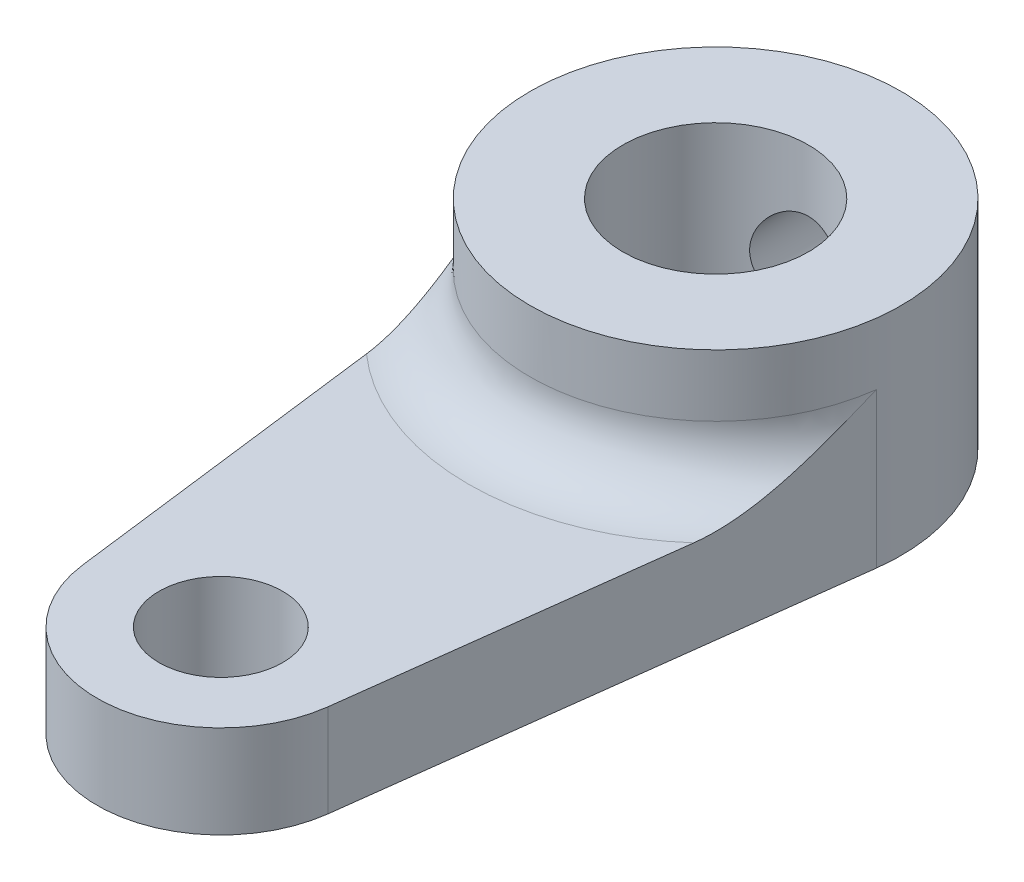
ISO-10303-21;
HEADER;
FILE_DESCRIPTION(('STEP AP214'),'2;1');
FILE_NAME('part.step','',(''),(''),'','','');
FILE_SCHEMA(('AUTOMOTIVE_DESIGN { 1 0 10303 214 1 1 1 1 }'));
ENDSEC;
DATA;
#1=APPLICATION_CONTEXT('core data for automotive mechanical design processes');
#2=APPLICATION_PROTOCOL_DEFINITION('international standard','automotive_design',2000,#1);
#3=PRODUCT_CONTEXT('',#1,'mechanical');
#4=PRODUCT('Part','Part','',(#3));
#5=PRODUCT_RELATED_PRODUCT_CATEGORY('part','',(#4));
#6=PRODUCT_DEFINITION_FORMATION('','',#4);
#7=PRODUCT_DEFINITION_CONTEXT('part definition',#1,'design');
#8=PRODUCT_DEFINITION('design','',#6,#7);
#9=PRODUCT_DEFINITION_SHAPE('','',#8);
#10=(LENGTH_UNIT() NAMED_UNIT(*) SI_UNIT(.MILLI.,.METRE.));
#11=(NAMED_UNIT(*) PLANE_ANGLE_UNIT() SI_UNIT($,.RADIAN.));
#12=(NAMED_UNIT(*) SI_UNIT($,.STERADIAN.) SOLID_ANGLE_UNIT());
#13=UNCERTAINTY_MEASURE_WITH_UNIT(LENGTH_MEASURE(1.E-05),#10,'distance_accuracy_value','');
#14=(GEOMETRIC_REPRESENTATION_CONTEXT(3) GLOBAL_UNCERTAINTY_ASSIGNED_CONTEXT((#13)) GLOBAL_UNIT_ASSIGNED_CONTEXT((#10,
#11,#12)) REPRESENTATION_CONTEXT('',''));
#15=CARTESIAN_POINT('',(0.,0.,0.));
#16=DIRECTION('',(0.,0.,1.));
#17=DIRECTION('',(1.,0.,0.));
#18=AXIS2_PLACEMENT_3D('',#15,#16,#17);
#19=CARTESIAN_POINT('',(0.,3.,-16.));
#20=DIRECTION('',(0.,1.,0.));
#21=DIRECTION('',(0.,0.,1.));
#22=AXIS2_PLACEMENT_3D('',#19,#20,#21);
#23=PLANE('',#22);
#24=DIRECTION('',(0.125,0.,-0.992156741649221));
#25=VECTOR('',#24,1.);
#26=CARTESIAN_POINT('',(5.95294044989533,3.,-15.25));
#27=LINE('',#26,#25);
#28=CARTESIAN_POINT('',(3.96862696659688,3.,0.5));
#29=VERTEX_POINT('',#28);
#30=CARTESIAN_POINT('',(5.29150262212918,3.,-10.));
#31=VERTEX_POINT('',#30);
#32=EDGE_CURVE('E105',#29,#31,#27,.T.);
#33=ORIENTED_EDGE('',*,*,#32,.T.);
#34=CARTESIAN_POINT('',(0.,3.,-16.));
#35=DIRECTION('',(0.,1.,0.));
#36=DIRECTION('',(0.,0.,1.));
#37=AXIS2_PLACEMENT_3D('',#34,#35,#36);
#38=CIRCLE('',#37,8.);
#39=CARTESIAN_POINT('',(-5.29150262212918,3.,-10.));
#40=VERTEX_POINT('',#39);
#41=EDGE_CURVE('E60',#31,#40,#38,.F.);
#42=ORIENTED_EDGE('',*,*,#41,.T.);
#43=DIRECTION('',(0.125,0.,0.992156741649221));
#44=VECTOR('',#43,1.);
#45=CARTESIAN_POINT('',(-5.95294044989533,3.,-15.25));
#46=LINE('',#45,#44);
#47=CARTESIAN_POINT('',(-3.96862696659688,3.,0.499999999999999));
#48=VERTEX_POINT('',#47);
#49=EDGE_CURVE('E83',#40,#48,#46,.T.);
#50=ORIENTED_EDGE('',*,*,#49,.T.);
#51=CARTESIAN_POINT('',(0.,3.,0.));
#52=DIRECTION('',(0.,1.,0.));
#53=DIRECTION('',(0.,0.,1.));
#54=AXIS2_PLACEMENT_3D('',#51,#52,#53);
#55=CIRCLE('',#54,4.);
#56=EDGE_CURVE('E87',#48,#29,#55,.T.);
#57=ORIENTED_EDGE('',*,*,#56,.T.);
#58=EDGE_LOOP('',(#33,#42,#50,#57));
#59=FACE_BOUND('',#58,.T.);
#60=CARTESIAN_POINT('',(0.,3.,0.));
#61=DIRECTION('',(0.,1.,0.));
#62=DIRECTION('',(0.,0.,1.));
#63=AXIS2_PLACEMENT_3D('',#60,#61,#62);
#64=CIRCLE('',#63,2.);
#65=CARTESIAN_POINT('',(0.,3.,2.));
#66=VERTEX_POINT('',#65);
#67=EDGE_CURVE('E114',#66,#66,#64,.T.);
#68=ORIENTED_EDGE('',*,*,#67,.F.);
#69=EDGE_LOOP('',(#68));
#70=FACE_BOUND('',#69,.T.);
#71=ADVANCED_FACE('F33',(#59,#70),#23,.T.);
#72=CARTESIAN_POINT('',(0.,0.,-16.));
#73=DIRECTION('',(0.,1.,0.));
#74=DIRECTION('',(0.,0.,1.));
#75=AXIS2_PLACEMENT_3D('',#72,#73,#74);
#76=PLANE('',#75);
#77=CARTESIAN_POINT('',(0.,0.,-16.));
#78=DIRECTION('',(0.,1.,0.));
#79=DIRECTION('',(0.,0.,1.));
#80=AXIS2_PLACEMENT_3D('',#77,#78,#79);
#81=CIRCLE('',#80,3.);
#82=CARTESIAN_POINT('',(0.,0.,-13.));
#83=VERTEX_POINT('',#82);
#84=EDGE_CURVE('E124',#83,#83,#81,.T.);
#85=ORIENTED_EDGE('',*,*,#84,.T.);
#86=EDGE_LOOP('',(#85));
#87=FACE_BOUND('',#86,.T.);
#88=CARTESIAN_POINT('',(0.,0.,-16.));
#89=DIRECTION('',(0.,1.,0.));
#90=DIRECTION('',(0.,0.,1.));
#91=AXIS2_PLACEMENT_3D('',#88,#89,#90);
#92=CIRCLE('',#91,6.);
#93=CARTESIAN_POINT('',(5.95294044989533,0.,-15.25));
#94=VERTEX_POINT('',#93);
#95=CARTESIAN_POINT('',(-5.95294044989533,0.,-15.25));
#96=VERTEX_POINT('',#95);
#97=EDGE_CURVE('E111',#94,#96,#92,.T.);
#98=ORIENTED_EDGE('',*,*,#97,.F.);
#99=DIRECTION('',(0.125,0.,-0.992156741649221));
#100=VECTOR('',#99,1.);
#101=CARTESIAN_POINT('',(5.95294044989533,0.,-15.25));
#102=LINE('',#101,#100);
#103=CARTESIAN_POINT('',(3.96862696659688,0.,0.5));
#104=VERTEX_POINT('',#103);
#105=EDGE_CURVE('E91',#104,#94,#102,.T.);
#106=ORIENTED_EDGE('',*,*,#105,.F.);
#107=CARTESIAN_POINT('',(0.,0.,0.));
#108=DIRECTION('',(0.,1.,0.));
#109=DIRECTION('',(0.,0.,1.));
#110=AXIS2_PLACEMENT_3D('',#107,#108,#109);
#111=CIRCLE('',#110,4.);
#112=CARTESIAN_POINT('',(-3.96862696659688,0.,0.499999999999999));
#113=VERTEX_POINT('',#112);
#114=EDGE_CURVE('E116',#113,#104,#111,.T.);
#115=ORIENTED_EDGE('',*,*,#114,.F.);
#116=DIRECTION('',(0.125,0.,0.992156741649221));
#117=VECTOR('',#116,1.);
#118=CARTESIAN_POINT('',(-5.95294044989533,0.,-15.25));
#119=LINE('',#118,#117);
#120=EDGE_CURVE('E97',#96,#113,#119,.T.);
#121=ORIENTED_EDGE('',*,*,#120,.F.);
#122=EDGE_LOOP('',(#98,#106,#115,#121));
#123=FACE_BOUND('',#122,.T.);
#124=CARTESIAN_POINT('',(0.,0.,0.));
#125=DIRECTION('',(0.,1.,0.));
#126=DIRECTION('',(0.,0.,1.));
#127=AXIS2_PLACEMENT_3D('',#124,#125,#126);
#128=CIRCLE('',#127,2.);
#129=CARTESIAN_POINT('',(0.,0.,2.));
#130=VERTEX_POINT('',#129);
#131=EDGE_CURVE('E186',#130,#130,#128,.T.);
#132=ORIENTED_EDGE('',*,*,#131,.T.);
#133=EDGE_LOOP('',(#132));
#134=FACE_BOUND('',#133,.T.);
#135=ADVANCED_FACE('F156',(#87,#123,#134),#76,.F.);
#136=CARTESIAN_POINT('',(0.,3.,-16.));
#137=DIRECTION('',(0.,-1.,0.));
#138=DIRECTION('',(0.,0.,-1.));
#139=AXIS2_PLACEMENT_3D('',#136,#137,#138);
#140=CYLINDRICAL_SURFACE('',#139,6.);
#141=CARTESIAN_POINT('',(0.,5.,-22.));
#142=CARTESIAN_POINT('',(-0.0828760886697311,4.99999767426184,-21.9999985986801));
#143=CARTESIAN_POINT('',(-0.165778157830763,4.99310844922621,-21.9982657813183));
#144=CARTESIAN_POINT('',(-0.329206323770533,4.965774848693,-21.9915211382989));
#145=CARTESIAN_POINT('',(-0.409731046870739,4.94532279046215,-21.9865074541997));
#146=CARTESIAN_POINT('',(-0.566020872182577,4.89156074653791,-21.9737562633204));
#147=CARTESIAN_POINT('',(-0.641791563430003,4.85826620128472,-21.9660220284209));
#148=CARTESIAN_POINT('',(-0.786672131904427,4.77981860995517,-21.9486534380759));
#149=CARTESIAN_POINT('',(-0.855781784348759,4.73466516388106,-21.9390190185405));
#150=CARTESIAN_POINT('',(-0.98680192730092,4.63279921034579,-21.918674135918));
#151=CARTESIAN_POINT('',(-1.04855569006107,4.57588842504082,-21.9079470714853));
#152=CARTESIAN_POINT('',(-1.1617489272033,4.45254779509108,-21.8867362011753));
#153=CARTESIAN_POINT('',(-1.21318723694913,4.3861168770535,-21.8762524228835));
#154=CARTESIAN_POINT('',(-1.30502654279903,4.24440477326256,-21.8565477569971));
#155=CARTESIAN_POINT('',(-1.34525221592536,4.1690067691896,-21.847347944706));
#156=CARTESIAN_POINT('',(-1.41239690855053,4.01225158834164,-21.8314949481222));
#157=CARTESIAN_POINT('',(-1.43931805543933,3.93089536667424,-21.8248413567279));
#158=CARTESIAN_POINT('',(-1.47855483680429,3.76625650179753,-21.8150047671755));
#159=CARTESIAN_POINT('',(-1.49115226833334,3.6830451039502,-21.8117549107543));
#160=CARTESIAN_POINT('',(-1.50226177506785,3.51563143098602,-21.8088936253774));
#161=CARTESIAN_POINT('',(-1.50077614181798,3.43142931930139,-21.8092816044864));
#162=CARTESIAN_POINT('',(-1.48398652463928,3.26658419225552,-21.8135920549662));
#163=CARTESIAN_POINT('',(-1.46901834019052,3.1859043785349,-21.8174286300188));
#164=CARTESIAN_POINT('',(-1.42622418690311,3.02823894908871,-21.8280670967648));
#165=CARTESIAN_POINT('',(-1.39839730206942,2.95125359697102,-21.834869199707));
#166=CARTESIAN_POINT('',(-1.33038947793715,2.80226198374793,-21.8507511390419));
#167=CARTESIAN_POINT('',(-1.29008666723291,2.73031382821045,-21.8598532746942));
#168=CARTESIAN_POINT('',(-1.19835627601495,2.59408129024316,-21.8792971084639));
#169=CARTESIAN_POINT('',(-1.14692674880884,2.52979825193274,-21.8896390233473));
#170=CARTESIAN_POINT('',(-1.03266342468122,2.4087963843056,-21.9107588053978));
#171=CARTESIAN_POINT('',(-0.969546258165859,2.35234550993865,-21.9215406947797));
#172=CARTESIAN_POINT('',(-0.8346119175037,2.2507787575361,-21.9420596557879));
#173=CARTESIAN_POINT('',(-0.762794477707944,2.20566322573643,-21.9517966954941));
#174=CARTESIAN_POINT('',(-0.612115888681392,2.12794941377561,-21.9691773209418));
#175=CARTESIAN_POINT('',(-0.533231393208624,2.09539465974557,-21.9768136012772));
#176=CARTESIAN_POINT('',(-0.370876008142883,2.04408269429043,-21.9890791699142));
#177=CARTESIAN_POINT('',(-0.287405999150485,2.02532284358186,-21.9937090333928));
#178=CARTESIAN_POINT('',(-0.120539970390027,2.00254243444116,-21.9993549927137));
#179=CARTESIAN_POINT('',(-0.0371967199882104,1.9981569739247,-22.0004605350828));
#180=CARTESIAN_POINT('',(0.129032874801507,2.00324900205549,-21.9991880481445));
#181=CARTESIAN_POINT('',(0.211919259644594,2.01272524279913,-21.9968103324185));
#182=CARTESIAN_POINT('',(0.373614268776491,2.04497090839138,-21.9888958112736));
#183=CARTESIAN_POINT('',(0.452465118968754,2.06754126347699,-21.9834063418581));
#184=CARTESIAN_POINT('',(0.605257292452511,2.12510708402845,-21.9698870663413));
#185=CARTESIAN_POINT('',(0.679198119032634,2.16010380431317,-21.9618570036989));
#186=CARTESIAN_POINT('',(0.821523134429847,2.24223612887473,-21.9439330792631));
#187=CARTESIAN_POINT('',(0.88978544183583,2.28957611239676,-21.9340086736693));
#188=CARTESIAN_POINT('',(1.01752661364325,2.39478990879697,-21.9134450918742));
#189=CARTESIAN_POINT('',(1.07700395897301,2.45266553961691,-21.902805792517));
#190=CARTESIAN_POINT('',(1.18699056807273,2.57900196084446,-21.8816895696077));
#191=CARTESIAN_POINT('',(1.23724386762203,2.64768770300242,-21.8712230418728));
#192=CARTESIAN_POINT('',(1.3255107590127,2.79273263446572,-21.8519287837724));
#193=CARTESIAN_POINT('',(1.36352489415794,2.86909148295975,-21.8431009806703));
#194=CARTESIAN_POINT('',(1.42595142060929,3.02690572241308,-21.8281809473466));
#195=CARTESIAN_POINT('',(1.45044439665406,3.10832762834401,-21.8220725529191));
#196=CARTESIAN_POINT('',(1.48534565995378,3.27430963788911,-21.8132674409018));
#197=CARTESIAN_POINT('',(1.49575702747866,3.35886905103249,-21.8105699771994));
#198=CARTESIAN_POINT('',(1.50203859033399,3.5261210238552,-21.8089490120396));
#199=CARTESIAN_POINT('',(1.49831789778012,3.60879743512473,-21.8099193272826));
#200=CARTESIAN_POINT('',(1.47737727831287,3.77230388866798,-21.8152790900784));
#201=CARTESIAN_POINT('',(1.46015762268677,3.85313396801365,-21.8196684689186));
#202=CARTESIAN_POINT('',(1.41293131944279,4.01020845906541,-21.8313126068272));
#203=CARTESIAN_POINT('',(1.38300140468038,4.08647730524021,-21.8385501523631));
#204=CARTESIAN_POINT('',(1.31126491360507,4.23296538271369,-21.8550775572483));
#205=CARTESIAN_POINT('',(1.26945669003419,4.30318377318692,-21.8643677012077));
#206=CARTESIAN_POINT('',(1.17386774863714,4.43755462900202,-21.8842563426351));
#207=CARTESIAN_POINT('',(1.11980316291225,4.50150107342396,-21.8948826483176));
#208=CARTESIAN_POINT('',(1.00178937118973,4.61954704479541,-21.9160802724629));
#209=CARTESIAN_POINT('',(0.937837821261145,4.67364423011297,-21.9266515772706));
#210=CARTESIAN_POINT('',(0.800467586702589,4.77141130856461,-21.9467765564766));
#211=CARTESIAN_POINT('',(0.726898422316386,4.81487461367158,-21.9563083336587));
#212=CARTESIAN_POINT('',(0.573266059510476,4.88874746294053,-21.9730492497512));
#213=CARTESIAN_POINT('',(0.493207563436739,4.91916636064854,-21.9802600519978));
#214=CARTESIAN_POINT('',(0.344410253243471,4.96157183032965,-21.9904805956554));
#215=CARTESIAN_POINT('',(0.276380170908068,4.97595124305343,-21.9940258505269));
#216=CARTESIAN_POINT('',(0.138906071536283,4.99516594362194,-21.9987860523195));
#217=CARTESIAN_POINT('',(0.0694621612426162,5.0000019493053,-22.0000011745089));
#218=CARTESIAN_POINT('',(0.,5.,-22.));
#219=B_SPLINE_CURVE_WITH_KNOTS('',3,(#141,#142,#143,#144,#145,#146,#147,#148,#149,#150,#151,
#152,#153,#154,#155,#156,#157,#158,#159,#160,#161,#162,#163,#164,#165,#166,#167,#168,#169,#170,
#171,#172,#173,#174,#175,#176,#177,#178,#179,#180,#181,#182,#183,#184,#185,#186,#187,#188,#189,
#190,#191,#192,#193,#194,#195,#196,#197,#198,#199,#200,#201,#202,#203,#204,#205,#206,#207,#208,
#209,#210,#211,#212,#213,#214,#215,#216,#217,#218),.UNSPECIFIED.,.T.,.F.,(4,2,2,2,2,2,2,2,2,2,2,
2,2,2,2,2,2,2,2,2,2,2,2,2,2,2,2,2,2,2,2,2,2,2,2,2,2,2,4),(0.,0.24837371247189,0.4968882377639,
0.745104902286106,0.993329940169328,1.24614435437139,1.49898729580062,1.75558647545807,
2.01214461169368,2.2635629509943,2.51494038112697,2.76022497007018,3.00552703466038,
3.25330527873879,3.50112690836163,3.75601500969019,4.01091089558247,4.26668229009114,
4.52240473688643,4.77158308949276,5.02073901112743,5.26620274514037,5.5116912732229,
5.76153587565352,6.01142363008019,6.26744509204476,6.52345518749508,6.77792254614036,
7.03233423252408,7.27943780398613,7.52653640956034,7.77216400559447,8.01782568136901,
8.2698957640991,8.52202569770418,8.77872185499588,9.0352336382135,9.24342242942149,
9.4515955604304),.UNSPECIFIED.);
#220=CARTESIAN_POINT('',(0.,5.,-22.));
#221=VERTEX_POINT('',#220);
#222=EDGE_CURVE('E128',#221,#221,#219,.T.);
#223=ORIENTED_EDGE('',*,*,#222,.T.);
#224=EDGE_LOOP('',(#223));
#225=FACE_BOUND('',#224,.T.);
#226=CARTESIAN_POINT('',(0.,5.,-16.));
#227=DIRECTION('',(0.,1.,0.));
#228=DIRECTION('',(0.,0.,1.));
#229=AXIS2_PLACEMENT_3D('',#226,#227,#228);
#230=CIRCLE('',#229,6.);
#231=CARTESIAN_POINT('',(-5.95294044989533,5.,-15.25));
#232=VERTEX_POINT('',#231);
#233=CARTESIAN_POINT('',(5.95294044989533,5.,-15.25));
#234=VERTEX_POINT('',#233);
#235=EDGE_CURVE('E123',#232,#234,#230,.T.);
#236=ORIENTED_EDGE('',*,*,#235,.T.);
#237=DIRECTION('',(0.,-1.,0.));
#238=VECTOR('',#237,1.);
#239=CARTESIAN_POINT('',(5.95294044989533,3.,-15.25));
#240=LINE('',#239,#238);
#241=EDGE_CURVE('E107',#234,#94,#240,.T.);
#242=ORIENTED_EDGE('',*,*,#241,.T.);
#243=ORIENTED_EDGE('',*,*,#97,.T.);
#244=DIRECTION('',(0.,-1.,0.));
#245=VECTOR('',#244,1.);
#246=CARTESIAN_POINT('',(-5.95294044989533,3.,-15.25));
#247=LINE('',#246,#245);
#248=EDGE_CURVE('E100',#232,#96,#247,.T.);
#249=ORIENTED_EDGE('',*,*,#248,.F.);
#250=EDGE_LOOP('',(#236,#242,#243,#249));
#251=FACE_BOUND('',#250,.T.);
#252=CARTESIAN_POINT('',(0.,7.,-16.));
#253=DIRECTION('',(0.,1.,0.));
#254=DIRECTION('',(0.,0.,1.));
#255=AXIS2_PLACEMENT_3D('',#252,#253,#254);
#256=CIRCLE('',#255,6.);
#257=CARTESIAN_POINT('',(0.,7.,-10.));
#258=VERTEX_POINT('',#257);
#259=EDGE_CURVE('E188',#258,#258,#256,.T.);
#260=ORIENTED_EDGE('',*,*,#259,.F.);
#261=EDGE_LOOP('',(#260));
#262=FACE_BOUND('',#261,.T.);
#263=ADVANCED_FACE('F153',(#225,#251,#262),#140,.T.);
#264=CARTESIAN_POINT('',(-5.95294044989533,3.,-15.25));
#265=DIRECTION('',(0.992156741649221,0.,-0.125));
#266=DIRECTION('',(-0.125,0.,-0.992156741649222));
#267=AXIS2_PLACEMENT_3D('',#264,#265,#266);
#268=PLANE('',#267);
#269=ORIENTED_EDGE('',*,*,#120,.T.);
#270=DIRECTION('',(0.,-1.,0.));
#271=VECTOR('',#270,1.);
#272=CARTESIAN_POINT('',(-3.96862696659688,3.,0.499999999999999));
#273=LINE('',#272,#271);
#274=EDGE_CURVE('E94',#48,#113,#273,.T.);
#275=ORIENTED_EDGE('',*,*,#274,.F.);
#276=ORIENTED_EDGE('',*,*,#49,.F.);
#277=CARTESIAN_POINT('',(-5.29150262212918,3.,-10.));
#278=CARTESIAN_POINT('',(-5.31039781985095,3.00003932371851,-10.1499759824356));
#279=CARTESIAN_POINT('',(-5.32927068108439,3.00749080861599,-10.2997746744913));
#280=CARTESIAN_POINT('',(-5.36682983971646,3.03529748814421,-10.5978912540712));
#281=CARTESIAN_POINT('',(-5.38551644968334,3.0556250650484,-10.7462116225289));
#282=CARTESIAN_POINT('',(-5.42237695613074,3.10690972129822,-11.038782822308));
#283=CARTESIAN_POINT('',(-5.44055436264517,3.13771036698699,-11.18306151366));
#284=CARTESIAN_POINT('',(-5.47663555915581,3.20848018103582,-11.4694471325783));
#285=CARTESIAN_POINT('',(-5.49453918362408,3.2484546789467,-11.6115527463075));
#286=CARTESIAN_POINT('',(-5.55104862359352,3.38804779430895,-12.0600825209676));
#287=CARTESIAN_POINT('',(-5.58909054596909,3.50228369716498,-12.3620309189693));
#288=CARTESIAN_POINT('',(-5.66384180156043,3.75580816906889,-12.9553506164229));
#289=CARTESIAN_POINT('',(-5.70054954085282,3.89512559194485,-13.2467092645));
#290=CARTESIAN_POINT('',(-5.80963672037374,4.33812108027589,-14.1125619092135));
#291=CARTESIAN_POINT('',(-5.88048240155494,4.66533067272958,-14.6748820708188));
#292=CARTESIAN_POINT('',(-5.95182241893327,4.99483605454535,-15.241125904349));
#293=CARTESIAN_POINT('',(-5.95238143594607,4.99741804396524,-15.2455629643326));
#294=CARTESIAN_POINT('',(-5.95294044989533,5.,-15.25));
#295=B_SPLINE_CURVE_WITH_KNOTS('',3,(#277,#278,#279,#280,#281,#282,#283,#284,#285,#286,#287,
#288,#289,#290,#291,#292,#293,#294),.UNSPECIFIED.,.F.,.F.,(4,2,2,2,2,2,2,2,4),(0.,
0.453047985172443,0.905127510165149,1.35073120961517,1.79659444088084,2.76988627914207,
3.74430503334854,5.70583133706968,5.72132327058453),.UNSPECIFIED.);
#296=EDGE_CURVE('E11',#40,#232,#295,.T.);
#297=ORIENTED_EDGE('',*,*,#296,.T.);
#298=ORIENTED_EDGE('',*,*,#248,.T.);
#299=EDGE_LOOP('',(#269,#275,#276,#297,#298));
#300=FACE_BOUND('',#299,.T.);
#301=ADVANCED_FACE('F95',(#300),#268,.F.);
#302=CARTESIAN_POINT('',(0.,3.,0.));
#303=DIRECTION('',(0.,-1.,0.));
#304=DIRECTION('',(0.,0.,-1.));
#305=AXIS2_PLACEMENT_3D('',#302,#303,#304);
#306=CYLINDRICAL_SURFACE('',#305,4.);
#307=ORIENTED_EDGE('',*,*,#114,.T.);
#308=DIRECTION('',(0.,-1.,0.));
#309=VECTOR('',#308,1.);
#310=CARTESIAN_POINT('',(3.96862696659688,3.,0.5));
#311=LINE('',#310,#309);
#312=EDGE_CURVE('E101',#29,#104,#311,.T.);
#313=ORIENTED_EDGE('',*,*,#312,.F.);
#314=ORIENTED_EDGE('',*,*,#56,.F.);
#315=ORIENTED_EDGE('',*,*,#274,.T.);
#316=EDGE_LOOP('',(#307,#313,#314,#315));
#317=FACE_BOUND('',#316,.T.);
#318=ADVANCED_FACE('F103',(#317),#306,.T.);
#319=CARTESIAN_POINT('',(5.95294044989533,3.,-15.25));
#320=DIRECTION('',(-0.992156741649221,0.,-0.125));
#321=DIRECTION('',(-0.125,0.,0.992156741649222));
#322=AXIS2_PLACEMENT_3D('',#319,#320,#321);
#323=PLANE('',#322);
#324=ORIENTED_EDGE('',*,*,#105,.T.);
#325=ORIENTED_EDGE('',*,*,#241,.F.);
#326=CARTESIAN_POINT('',(5.29150262212918,3.,-10.));
#327=CARTESIAN_POINT('',(5.31039781985098,3.00003932371851,-10.1499759824358));
#328=CARTESIAN_POINT('',(5.32927068108445,3.00749080861602,-10.2997746744918));
#329=CARTESIAN_POINT('',(5.36682983971658,3.03529748814432,-10.5978912540722));
#330=CARTESIAN_POINT('',(5.38551644968349,3.05562506504857,-10.74621162253));
#331=CARTESIAN_POINT('',(5.42237695613088,3.10690972129846,-11.0387828223091));
#332=CARTESIAN_POINT('',(5.44055436264528,3.1377103669872,-11.1830615136608));
#333=CARTESIAN_POINT('',(5.47663555915586,3.20848018103593,-11.4694471325788));
#334=CARTESIAN_POINT('',(5.4945391836241,3.24845467894674,-11.6115527463077));
#335=CARTESIAN_POINT('',(5.55104862359351,3.38804779430899,-12.0600825209675));
#336=CARTESIAN_POINT('',(5.58909054596905,3.50228369716525,-12.362030918969));
#337=CARTESIAN_POINT('',(5.66384180156041,3.75580816906842,-12.9553506164227));
#338=CARTESIAN_POINT('',(5.70054954085284,3.89512559194338,-13.2467092645002));
#339=CARTESIAN_POINT('',(5.80963672037351,4.33812108027807,-14.1125619092117));
#340=CARTESIAN_POINT('',(5.88048240155395,4.6653306727429,-14.674882070811));
#341=CARTESIAN_POINT('',(5.95182241893326,4.9948360545456,-15.2411259043489));
#342=CARTESIAN_POINT('',(5.95238143594607,4.99741804396537,-15.2455629643325));
#343=CARTESIAN_POINT('',(5.95294044989533,5.,-15.25));
#344=B_SPLINE_CURVE_WITH_KNOTS('',3,(#326,#327,#328,#329,#330,#331,#332,#333,#334,#335,#336,
#337,#338,#339,#340,#341,#342,#343),.UNSPECIFIED.,.F.,.F.,(4,2,2,2,2,2,2,2,4),(0.,
0.453047985173229,0.90512751016655,1.35073120961582,1.79659444088084,2.76988627914188,
3.74430503334772,5.70583133706978,5.72132327058452),.UNSPECIFIED.);
#345=EDGE_CURVE('E47',#234,#31,#344,.F.);
#346=ORIENTED_EDGE('',*,*,#345,.T.);
#347=ORIENTED_EDGE('',*,*,#32,.F.);
#348=ORIENTED_EDGE('',*,*,#312,.T.);
#349=EDGE_LOOP('',(#324,#325,#346,#347,#348));
#350=FACE_BOUND('',#349,.T.);
#351=ADVANCED_FACE('F163',(#350),#323,.F.);
#352=CARTESIAN_POINT('',(0.,3.,0.));
#353=DIRECTION('',(0.,-1.,0.));
#354=DIRECTION('',(0.,0.,-1.));
#355=AXIS2_PLACEMENT_3D('',#352,#353,#354);
#356=CYLINDRICAL_SURFACE('',#355,2.);
#357=ORIENTED_EDGE('',*,*,#67,.T.);
#358=EDGE_LOOP('',(#357));
#359=FACE_BOUND('',#358,.T.);
#360=ORIENTED_EDGE('',*,*,#131,.F.);
#361=EDGE_LOOP('',(#360));
#362=FACE_BOUND('',#361,.T.);
#363=ADVANCED_FACE('F167',(#359,#362),#356,.F.);
#364=CARTESIAN_POINT('',(0.,7.,-16.));
#365=DIRECTION('',(0.,1.,0.));
#366=DIRECTION('',(0.,0.,1.));
#367=AXIS2_PLACEMENT_3D('',#364,#365,#366);
#368=PLANE('',#367);
#369=ORIENTED_EDGE('',*,*,#259,.T.);
#370=EDGE_LOOP('',(#369));
#371=FACE_BOUND('',#370,.T.);
#372=CARTESIAN_POINT('',(0.,7.,-16.));
#373=DIRECTION('',(0.,1.,0.));
#374=DIRECTION('',(0.,0.,1.));
#375=AXIS2_PLACEMENT_3D('',#372,#373,#374);
#376=CIRCLE('',#375,3.);
#377=CARTESIAN_POINT('',(0.,7.,-13.));
#378=VERTEX_POINT('',#377);
#379=EDGE_CURVE('E127',#378,#378,#376,.T.);
#380=ORIENTED_EDGE('',*,*,#379,.F.);
#381=EDGE_LOOP('',(#380));
#382=FACE_BOUND('',#381,.T.);
#383=ADVANCED_FACE('F199',(#371,#382),#368,.T.);
#384=CARTESIAN_POINT('',(0.,7.,-16.));
#385=DIRECTION('',(0.,-1.,0.));
#386=DIRECTION('',(0.,0.,-1.));
#387=AXIS2_PLACEMENT_3D('',#384,#385,#386);
#388=CYLINDRICAL_SURFACE('',#387,3.);
#389=CARTESIAN_POINT('',(0.,5.,-19.));
#390=CARTESIAN_POINT('',(-0.0788579444268502,4.99999504652421,-18.9999957010756));
#391=CARTESIAN_POINT('',(-0.157809899546344,4.99374489031842,-18.9968573652963));
#392=CARTESIAN_POINT('',(-0.313380352903344,4.96902067948769,-18.9846123405574));
#393=CARTESIAN_POINT('',(-0.389994130070444,4.95052341050328,-18.9754943174338));
#394=CARTESIAN_POINT('',(-0.538400317320673,4.90220928707506,-18.9522441910506));
#395=CARTESIAN_POINT('',(-0.610210204408719,4.87243642362805,-18.9381315876631));
#396=CARTESIAN_POINT('',(-0.747708925209898,4.80264406795252,-18.9061866477364));
#397=CARTESIAN_POINT('',(-0.813398240985089,4.7626253836267,-18.8883546045029));
#398=CARTESIAN_POINT('',(-0.941261726642864,4.67072412577207,-18.8493438738709));
#399=CARTESIAN_POINT('',(-1.00298281668316,4.61827028114054,-18.8280279869131));
#400=CARTESIAN_POINT('',(-1.11716916730047,4.50421778112945,-18.7848995537011));
#401=CARTESIAN_POINT('',(-1.16962737466015,4.44261222234134,-18.7630866431355));
#402=CARTESIAN_POINT('',(-1.26787800067542,4.30627497571493,-18.7194842679602));
#403=CARTESIAN_POINT('',(-1.31283800332745,4.23089585248113,-18.697827804552));
#404=CARTESIAN_POINT('',(-1.38925234033604,4.07244899602068,-18.6592896815848));
#405=CARTESIAN_POINT('',(-1.4207163224495,3.98938680691588,-18.6424046141048));
#406=CARTESIAN_POINT('',(-1.46719866328288,3.82300234186712,-18.6168680055671));
#407=CARTESIAN_POINT('',(-1.48308878562066,3.73999332189891,-18.6077840737557));
#408=CARTESIAN_POINT('',(-1.50064048996327,3.57203174333079,-18.5977283492279));
#409=CARTESIAN_POINT('',(-1.50231613255961,3.48708118869327,-18.5967485401493));
#410=CARTESIAN_POINT('',(-1.49203093075844,3.32857096352695,-18.6026639538587));
#411=CARTESIAN_POINT('',(-1.48167683930523,3.25486395316543,-18.6086314549302));
#412=CARTESIAN_POINT('',(-1.4504097735854,3.11041713594044,-18.6261434310078));
#413=CARTESIAN_POINT('',(-1.42949343584648,3.03967828204203,-18.6376896824766));
#414=CARTESIAN_POINT('',(-1.37731467057901,2.90115630115151,-18.6653121461911));
#415=CARTESIAN_POINT('',(-1.34582260067399,2.83348040182132,-18.68148760996));
#416=CARTESIAN_POINT('',(-1.273562531502,2.70404856111499,-18.7165510642211));
#417=CARTESIAN_POINT('',(-1.2327903657187,2.64229529659987,-18.7354402717029));
#418=CARTESIAN_POINT('',(-1.13709908236918,2.51821812088516,-18.7766973685493));
#419=CARTESIAN_POINT('',(-1.08104168755392,2.45681468963576,-18.7992026535512));
#420=CARTESIAN_POINT('',(-0.95933336811206,2.34389687211365,-18.8432143495061));
#421=CARTESIAN_POINT('',(-0.893677884861428,2.29238721194918,-18.864720279382));
#422=CARTESIAN_POINT('',(-0.750774758747773,2.19847150845541,-18.9055298092445));
#423=CARTESIAN_POINT('',(-0.673130387399113,2.15659929133139,-18.9246847624301));
#424=CARTESIAN_POINT('',(-0.510699323233195,2.08685445643549,-18.9573682168186));
#425=CARTESIAN_POINT('',(-0.425918364397913,2.05897072247725,-18.9709011841533));
#426=CARTESIAN_POINT('',(-0.259149737491053,2.02028689442499,-18.9898650061215));
#427=CARTESIAN_POINT('',(-0.177512295822489,2.00826314637983,-18.9958740745197));
#428=CARTESIAN_POINT('',(-0.0131693999240274,1.99780290329827,-19.0010952018866));
#429=CARTESIAN_POINT('',(0.0695355298048632,1.9993599715408,-19.0003104808198));
#430=CARTESIAN_POINT('',(0.22684945797898,2.01531003262812,-18.9923678838015));
#431=CARTESIAN_POINT('',(0.301589112074895,2.02869879909499,-18.9857086853225));
#432=CARTESIAN_POINT('',(0.447610338452911,2.06635710784268,-18.9673325697226));
#433=CARTESIAN_POINT('',(0.51889152853663,2.09062784968024,-18.9556150950162));
#434=CARTESIAN_POINT('',(0.658332912674359,2.14999769964955,-18.9277637712038));
#435=CARTESIAN_POINT('',(0.726345595508705,2.18538657517443,-18.9115132265445));
#436=CARTESIAN_POINT('',(0.855692042548907,2.26566130346985,-18.8761596147613));
#437=CARTESIAN_POINT('',(0.917022944664887,2.31055120189309,-18.8570553335041));
#438=CARTESIAN_POINT('',(1.03765153393382,2.41364063799607,-18.815623320043));
#439=CARTESIAN_POINT('',(1.09615811672854,2.47271430266772,-18.7931632726525));
#440=CARTESIAN_POINT('',(1.20278448167828,2.59988772691659,-18.7489358741323));
#441=CARTESIAN_POINT('',(1.25089707856781,2.66799367827188,-18.7271690110007));
#442=CARTESIAN_POINT('',(1.33756187171853,2.81546548125946,-18.6857678830973));
#443=CARTESIAN_POINT('',(1.37553824370037,2.89521689914172,-18.6662879438359));
#444=CARTESIAN_POINT('',(1.43712423890205,3.06126510136245,-18.633611084412));
#445=CARTESIAN_POINT('',(1.46075237380052,3.14755328970033,-18.6204060733263));
#446=CARTESIAN_POINT('',(1.49079253120031,3.31536533432706,-18.603422515387));
#447=CARTESIAN_POINT('',(1.49863949460818,3.39655138015286,-18.598860751976));
#448=CARTESIAN_POINT('',(1.5010337315643,3.55917060074679,-18.597480319624));
#449=CARTESIAN_POINT('',(1.49558676993486,3.64060365310679,-18.6006582943958));
#450=CARTESIAN_POINT('',(1.47288918838996,3.79322525230016,-18.6135679307661));
#451=CARTESIAN_POINT('',(1.45681247151455,3.86465070521711,-18.6226464172399));
#452=CARTESIAN_POINT('',(1.41476303733662,4.00371217913655,-18.6455652428148));
#453=CARTESIAN_POINT('',(1.38878713673988,4.07134697313805,-18.659407113545));
#454=CARTESIAN_POINT('',(1.32572361795085,4.2059372764798,-18.691427955468));
#455=CARTESIAN_POINT('',(1.28800670672355,4.27254185274354,-18.7098358359388));
#456=CARTESIAN_POINT('',(1.20322645745609,4.39891180427189,-18.7485299745229));
#457=CARTESIAN_POINT('',(1.15615825686234,4.45867359578167,-18.7688172069342));
#458=CARTESIAN_POINT('',(1.04730498999206,4.57721297353201,-18.8119348473714));
#459=CARTESIAN_POINT('',(0.984426634495891,4.63498865352544,-18.8347747495994));
#460=CARTESIAN_POINT('',(0.849232209349795,4.7393944751529,-18.878166283899));
#461=CARTESIAN_POINT('',(0.776911084957795,4.78601860920486,-18.8987166793929));
#462=CARTESIAN_POINT('',(0.623897395174419,4.86685454406811,-18.9354701434981));
#463=CARTESIAN_POINT('',(0.543149255665096,4.9009762538547,-18.951641447409));
#464=CARTESIAN_POINT('',(0.37611315170713,4.95471225163611,-18.9775201194848));
#465=CARTESIAN_POINT('',(0.28984169938365,4.97436777020857,-18.987245850446));
#466=CARTESIAN_POINT('',(0.168902919736343,4.99084611662861,-18.9954319287022));
#467=CARTESIAN_POINT('',(0.135242819162348,4.99427396129951,-18.9971404801038));
#468=CARTESIAN_POINT('',(0.0677275977076382,4.99885199827113,-18.9994254546522));
#469=CARTESIAN_POINT('',(0.0338724714699431,5.00000212770531,-19.0000018465507));
#470=CARTESIAN_POINT('',(0.,5.,-19.));
#471=B_SPLINE_CURVE_WITH_KNOTS('',3,(#389,#390,#391,#392,#393,#394,#395,#396,#397,#398,#399,
#400,#401,#402,#403,#404,#405,#406,#407,#408,#409,#410,#411,#412,#413,#414,#415,#416,#417,#418,
#419,#420,#421,#422,#423,#424,#425,#426,#427,#428,#429,#430,#431,#432,#433,#434,#435,#436,#437,
#438,#439,#440,#441,#442,#443,#444,#445,#446,#447,#448,#449,#450,#451,#452,#453,#454,#455,#456,
#457,#458,#459,#460,#461,#462,#463,#464,#465,#466,#467,#468,#469,#470),.UNSPECIFIED.,.T.,.F.,(4,
2,2,2,2,2,2,2,2,2,2,2,2,2,2,2,2,2,2,2,2,2,2,2,2,2,2,2,2,2,2,2,2,2,2,2,2,2,2,2,4),(0.,
0.236436386130439,0.473322224563796,0.709293233238447,0.945245640872351,1.19547263807713,
1.44588935648105,1.71572589646129,1.98536921847421,2.23887018210344,2.49212035993531,
2.71508568613981,2.93812205888518,3.16635360252731,3.39468781890333,3.65197412000818,
3.90938301898029,4.17874533321661,4.44789325368419,4.69474935707018,4.94148846767214,
5.16910359759183,5.39674382446397,5.63089284041848,5.86514176122509,6.12239415966628,
6.37982382923147,6.64972023242588,6.91926767918176,7.16293961254569,7.40650589797017,
7.62686895373283,7.84730293182526,8.0825468517043,8.31791341715446,8.58187864135757,
8.84598575071868,9.1119602049529,9.37717362931724,9.47872920200875,9.58028757766599),.UNSPECIFIED.);
#472=CARTESIAN_POINT('',(0.,5.,-19.));
#473=VERTEX_POINT('',#472);
#474=EDGE_CURVE('E129',#473,#473,#471,.T.);
#475=ORIENTED_EDGE('',*,*,#474,.F.);
#476=EDGE_LOOP('',(#475));
#477=FACE_BOUND('',#476,.T.);
#478=ORIENTED_EDGE('',*,*,#379,.T.);
#479=EDGE_LOOP('',(#478));
#480=FACE_BOUND('',#479,.T.);
#481=ORIENTED_EDGE('',*,*,#84,.F.);
#482=EDGE_LOOP('',(#481));
#483=FACE_BOUND('',#482,.T.);
#484=ADVANCED_FACE('F138',(#477,#480,#483),#388,.F.);
#485=CARTESIAN_POINT('',(0.,3.5,-45.));
#486=DIRECTION('',(0.,0.,1.));
#487=DIRECTION('',(1.,0.,0.));
#488=AXIS2_PLACEMENT_3D('',#485,#486,#487);
#489=CYLINDRICAL_SURFACE('',#488,1.5);
#490=ORIENTED_EDGE('',*,*,#474,.T.);
#491=EDGE_LOOP('',(#490));
#492=FACE_BOUND('',#491,.T.);
#493=ORIENTED_EDGE('',*,*,#222,.F.);
#494=EDGE_LOOP('',(#493));
#495=FACE_BOUND('',#494,.T.);
#496=ADVANCED_FACE('F141',(#492,#495),#489,.F.);
#497=CARTESIAN_POINT('',(0.,5.,-16.));
#498=DIRECTION('',(0.,1.,0.));
#499=DIRECTION('',(0.,0.,1.));
#500=AXIS2_PLACEMENT_3D('',#497,#498,#499);
#501=TOROIDAL_SURFACE('',#500,8.,2.);
#502=ORIENTED_EDGE('',*,*,#296,.F.);
#503=ORIENTED_EDGE('',*,*,#41,.F.);
#504=ORIENTED_EDGE('',*,*,#345,.F.);
#505=ORIENTED_EDGE('',*,*,#235,.F.);
#506=EDGE_LOOP('',(#502,#503,#504,#505));
#507=FACE_BOUND('',#506,.T.);
#508=ADVANCED_FACE('F35',(#507),#501,.F.);
#509=CLOSED_SHELL('',(#71,#135,#263,#301,#318,#351,#363,#383,#484,#496,#508));
#510=MANIFOLD_SOLID_BREP('B2',#509);
#511=ADVANCED_BREP_SHAPE_REPRESENTATION('',(#18,#510),#14);
#512=SHAPE_DEFINITION_REPRESENTATION(#9,#511);
ENDSEC;
END-ISO-10303-21;
